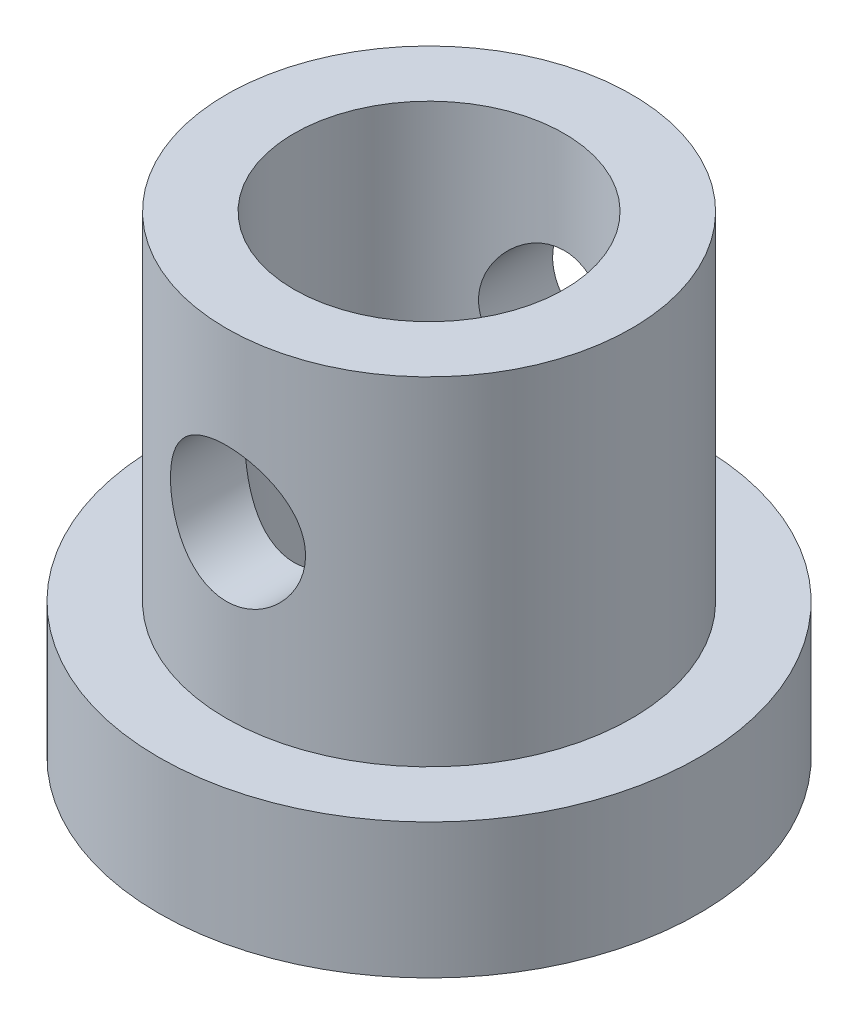
ISO-10303-21;
HEADER;
FILE_DESCRIPTION(('STEP AP214'),'2;1');
FILE_NAME('part.step','',(''),(''),'','','');
FILE_SCHEMA(('AUTOMOTIVE_DESIGN { 1 0 10303 214 1 1 1 1 }'));
ENDSEC;
DATA;
#1=APPLICATION_CONTEXT('core data for automotive mechanical design processes');
#2=APPLICATION_PROTOCOL_DEFINITION('international standard','automotive_design',2000,#1);
#3=PRODUCT_CONTEXT('',#1,'mechanical');
#4=PRODUCT('Part','Part','',(#3));
#5=PRODUCT_RELATED_PRODUCT_CATEGORY('part','',(#4));
#6=PRODUCT_DEFINITION_FORMATION('','',#4);
#7=PRODUCT_DEFINITION_CONTEXT('part definition',#1,'design');
#8=PRODUCT_DEFINITION('design','',#6,#7);
#9=PRODUCT_DEFINITION_SHAPE('','',#8);
#10=(LENGTH_UNIT() NAMED_UNIT(*) SI_UNIT(.MILLI.,.METRE.));
#11=(NAMED_UNIT(*) PLANE_ANGLE_UNIT() SI_UNIT($,.RADIAN.));
#12=(NAMED_UNIT(*) SI_UNIT($,.STERADIAN.) SOLID_ANGLE_UNIT());
#13=UNCERTAINTY_MEASURE_WITH_UNIT(LENGTH_MEASURE(1.E-05),#10,'distance_accuracy_value','');
#14=(GEOMETRIC_REPRESENTATION_CONTEXT(3) GLOBAL_UNCERTAINTY_ASSIGNED_CONTEXT((#13)) GLOBAL_UNIT_ASSIGNED_CONTEXT((#10,
#11,#12)) REPRESENTATION_CONTEXT('',''));
#15=CARTESIAN_POINT('',(0.,0.,0.));
#16=DIRECTION('',(0.,0.,1.));
#17=DIRECTION('',(1.,0.,0.));
#18=AXIS2_PLACEMENT_3D('',#15,#16,#17);
#19=CARTESIAN_POINT('',(0.,2.,0.));
#20=DIRECTION('',(0.,1.,0.));
#21=DIRECTION('',(0.,0.,1.));
#22=AXIS2_PLACEMENT_3D('',#19,#20,#21);
#23=PLANE('',#22);
#24=CARTESIAN_POINT('',(0.,2.,0.));
#25=DIRECTION('',(0.,1.,0.));
#26=DIRECTION('',(0.,0.,1.));
#27=AXIS2_PLACEMENT_3D('',#24,#25,#26);
#28=CIRCLE('',#27,4.);
#29=CARTESIAN_POINT('',(0.,2.,4.));
#30=VERTEX_POINT('',#29);
#31=EDGE_CURVE('E10',#30,#30,#28,.T.);
#32=ORIENTED_EDGE('',*,*,#31,.T.);
#33=EDGE_LOOP('',(#32));
#34=FACE_BOUND('',#33,.T.);
#35=CARTESIAN_POINT('',(0.,2.,0.));
#36=DIRECTION('',(0.,1.,0.));
#37=DIRECTION('',(0.,0.,1.));
#38=AXIS2_PLACEMENT_3D('',#35,#36,#37);
#39=CIRCLE('',#38,3.);
#40=CARTESIAN_POINT('',(0.,2.,3.));
#41=VERTEX_POINT('',#40);
#42=EDGE_CURVE('E118',#41,#41,#39,.T.);
#43=ORIENTED_EDGE('',*,*,#42,.F.);
#44=EDGE_LOOP('',(#43));
#45=FACE_BOUND('',#44,.T.);
#46=ADVANCED_FACE('F39',(#34,#45),#23,.T.);
#47=CARTESIAN_POINT('',(0.,0.,0.));
#48=DIRECTION('',(0.,1.,0.));
#49=DIRECTION('',(0.,0.,1.));
#50=AXIS2_PLACEMENT_3D('',#47,#48,#49);
#51=PLANE('',#50);
#52=CARTESIAN_POINT('',(0.,0.,0.));
#53=DIRECTION('',(0.,1.,0.));
#54=DIRECTION('',(0.,0.,1.));
#55=AXIS2_PLACEMENT_3D('',#52,#53,#54);
#56=CIRCLE('',#55,4.);
#57=CARTESIAN_POINT('',(0.,0.,4.));
#58=VERTEX_POINT('',#57);
#59=EDGE_CURVE('E53',#58,#58,#56,.T.);
#60=ORIENTED_EDGE('',*,*,#59,.F.);
#61=EDGE_LOOP('',(#60));
#62=FACE_BOUND('',#61,.T.);
#63=CARTESIAN_POINT('',(0.,0.,0.));
#64=DIRECTION('',(0.,1.,0.));
#65=DIRECTION('',(0.,0.,1.));
#66=AXIS2_PLACEMENT_3D('',#63,#64,#65);
#67=CIRCLE('',#66,2.);
#68=CARTESIAN_POINT('',(0.,0.,2.));
#69=VERTEX_POINT('',#68);
#70=EDGE_CURVE('E59',#69,#69,#67,.T.);
#71=ORIENTED_EDGE('',*,*,#70,.T.);
#72=EDGE_LOOP('',(#71));
#73=FACE_BOUND('',#72,.T.);
#74=ADVANCED_FACE('F102',(#62,#73),#51,.F.);
#75=CARTESIAN_POINT('',(0.,2.,0.));
#76=DIRECTION('',(0.,-1.,0.));
#77=DIRECTION('',(0.,0.,-1.));
#78=AXIS2_PLACEMENT_3D('',#75,#76,#77);
#79=CYLINDRICAL_SURFACE('',#78,4.);
#80=ORIENTED_EDGE('',*,*,#31,.F.);
#81=EDGE_LOOP('',(#80));
#82=FACE_BOUND('',#81,.T.);
#83=ORIENTED_EDGE('',*,*,#59,.T.);
#84=EDGE_LOOP('',(#83));
#85=FACE_BOUND('',#84,.T.);
#86=ADVANCED_FACE('F41',(#82,#85),#79,.T.);
#87=CARTESIAN_POINT('',(0.,2.,0.));
#88=DIRECTION('',(0.,-1.,0.));
#89=DIRECTION('',(0.,0.,-1.));
#90=AXIS2_PLACEMENT_3D('',#87,#88,#89);
#91=CYLINDRICAL_SURFACE('',#90,2.);
#92=CARTESIAN_POINT('',(0.,5.5,-2.));
#93=CARTESIAN_POINT('',(-0.0525719629529865,5.4999966976805,-1.99999713404151));
#94=CARTESIAN_POINT('',(-0.105206599698033,5.49582992687833,-1.99790491019518));
#95=CARTESIAN_POINT('',(-0.208920235268425,5.47934711965908,-1.98974156037396));
#96=CARTESIAN_POINT('',(-0.259996086713504,5.46701560700235,-1.98366287828984));
#97=CARTESIAN_POINT('',(-0.358933544880574,5.43480619138321,-1.96816279403312));
#98=CARTESIAN_POINT('',(-0.40680680293918,5.41495761575199,-1.9587543917752));
#99=CARTESIAN_POINT('',(-0.498472616806565,5.36842937863506,-1.93745776515779));
#100=CARTESIAN_POINT('',(-0.54226549399005,5.34175025575115,-1.9255697363353));
#101=CARTESIAN_POINT('',(-0.627507817761919,5.2804827505147,-1.89956258258057));
#102=CARTESIAN_POINT('',(-0.668655211122112,5.24551352076036,-1.88535199127536));
#103=CARTESIAN_POINT('',(-0.744779444866977,5.16947852075297,-1.85659970246744));
#104=CARTESIAN_POINT('',(-0.779751583106766,5.12840814822756,-1.84205776209035));
#105=CARTESIAN_POINT('',(-0.845252000450278,5.03751665047662,-1.81298951197347));
#106=CARTESIAN_POINT('',(-0.875225335551637,4.98726390165409,-1.79855186970132));
#107=CARTESIAN_POINT('',(-0.926168226890695,4.88163266401379,-1.77285978772321));
#108=CARTESIAN_POINT('',(-0.947144214966334,4.82625787127725,-1.7616030760699));
#109=CARTESIAN_POINT('',(-0.978132442188588,4.71533489457808,-1.74457867037809));
#110=CARTESIAN_POINT('',(-0.988725857080441,4.65999554793261,-1.73852271583714));
#111=CARTESIAN_POINT('',(-1.00042699330885,4.54802116222052,-1.73181889948528));
#112=CARTESIAN_POINT('',(-1.00154408837307,4.49138745912885,-1.73116569343288));
#113=CARTESIAN_POINT('',(-0.994687287172294,4.38571397568463,-1.73510930257248));
#114=CARTESIAN_POINT('',(-0.987784559536821,4.33657596877695,-1.73908763662014));
#115=CARTESIAN_POINT('',(-0.966939849056932,4.24027809062696,-1.7507622873385));
#116=CARTESIAN_POINT('',(-0.952995623897652,4.19311885469468,-1.75845978831776));
#117=CARTESIAN_POINT('',(-0.918209780386004,4.10077086743434,-1.77687476412741));
#118=CARTESIAN_POINT('',(-0.897215067115995,4.05565360121421,-1.78765840663999));
#119=CARTESIAN_POINT('',(-0.849041687668002,3.96936570740999,-1.81103404281404));
#120=CARTESIAN_POINT('',(-0.821860243812467,3.92819686439991,-1.82362684780191));
#121=CARTESIAN_POINT('',(-0.758066054912788,3.84547874725677,-1.85113157903286));
#122=CARTESIAN_POINT('',(-0.720694458369281,3.80454312642384,-1.86613510236746));
#123=CARTESIAN_POINT('',(-0.639555578741373,3.7292645814091,-1.89547623300407));
#124=CARTESIAN_POINT('',(-0.595785256574285,3.69492480796612,-1.90981351958801));
#125=CARTESIAN_POINT('',(-0.500516505831848,3.63231433897027,-1.93701987282964));
#126=CARTESIAN_POINT('',(-0.448753591599409,3.60439952755426,-1.94978984162007));
#127=CARTESIAN_POINT('',(-0.340466215488797,3.55790297095699,-1.97157881121242));
#128=CARTESIAN_POINT('',(-0.283945576265277,3.53931381498483,-1.98060078943553));
#129=CARTESIAN_POINT('',(-0.172766491660702,3.51352459628332,-1.99324333741436));
#130=CARTESIAN_POINT('',(-0.118341530548324,3.50550876425322,-1.99724938301312));
#131=CARTESIAN_POINT('',(-0.0087795999493535,3.49853526886551,-2.00073013459102));
#132=CARTESIAN_POINT('',(0.0463570198699014,3.49957331436052,-2.00020698721312));
#133=CARTESIAN_POINT('',(0.151232971985994,3.51020668841875,-1.99491192253441));
#134=CARTESIAN_POINT('',(0.201059408049954,3.51913253273003,-1.9904724568819));
#135=CARTESIAN_POINT('',(0.298406892301917,3.54423807189509,-1.97822171314819));
#136=CARTESIAN_POINT('',(0.345927685690997,3.56041856645336,-1.97041006334332));
#137=CARTESIAN_POINT('',(0.438888608449665,3.59999846643317,-1.95184251413669));
#138=CARTESIAN_POINT('',(0.484230397006154,3.62359105011681,-1.94100881769939));
#139=CARTESIAN_POINT('',(0.570461361698921,3.67710753564604,-1.91743974317109));
#140=CARTESIAN_POINT('',(0.611348629775282,3.70703413459343,-1.90470355565785));
#141=CARTESIAN_POINT('',(0.691767689290653,3.77576042533287,-1.87708221337464));
#142=CARTESIAN_POINT('',(0.730772077824639,3.81514286845357,-1.86210884848441));
#143=CARTESIAN_POINT('',(0.80185632111324,3.89992515126931,-1.83262391603874));
#144=CARTESIAN_POINT('',(0.833931385690841,3.94532911881638,-1.81811267381526));
#145=CARTESIAN_POINT('',(0.891707914497696,4.04364365420031,-1.79051192226068));
#146=CARTESIAN_POINT('',(0.917025495878637,4.09681126620859,-1.77752529663472));
#147=CARTESIAN_POINT('',(0.958082826013803,4.20751006769252,-1.75574072368126));
#148=CARTESIAN_POINT('',(0.97383491588757,4.26503552650119,-1.74693738240618));
#149=CARTESIAN_POINT('',(0.993861687449679,4.37691022286145,-1.73561501008667));
#150=CARTESIAN_POINT('',(0.999092996400865,4.43103425342904,-1.73257383460491));
#151=CARTESIAN_POINT('',(1.00068915438079,4.53944706717073,-1.73165354646175));
#152=CARTESIAN_POINT('',(0.997057846624399,4.59373576873943,-1.73377219627553));
#153=CARTESIAN_POINT('',(0.981926125592263,4.69548350153202,-1.74237862050025));
#154=CARTESIAN_POINT('',(0.9712083143428,4.7431004701444,-1.74843094482394));
#155=CARTESIAN_POINT('',(0.943175358224645,4.83580811942471,-1.76371016187917));
#156=CARTESIAN_POINT('',(0.92585809115981,4.88089798209197,-1.77293807569676));
#157=CARTESIAN_POINT('',(0.883815745300683,4.97062485098661,-1.79428530364528));
#158=CARTESIAN_POINT('',(0.858671137816457,5.0150279018297,-1.80655722396191));
#159=CARTESIAN_POINT('',(0.802150971636633,5.09927453618059,-1.8323533163459));
#160=CARTESIAN_POINT('',(0.770772171238647,5.13911573051849,-1.84587813794522));
#161=CARTESIAN_POINT('',(0.698203326664641,5.21814198235762,-1.87462323159313));
#162=CARTESIAN_POINT('',(0.656284423010171,5.25665910236192,-1.88984983311469));
#163=CARTESIAN_POINT('',(0.56615480622028,5.32626298342363,-1.91877752255088));
#164=CARTESIAN_POINT('',(0.517940723256785,5.35734573942629,-1.9324777860804));
#165=CARTESIAN_POINT('',(0.415931596819947,5.4112363627622,-1.95698009585103));
#166=CARTESIAN_POINT('',(0.362099503934615,5.43398416941144,-1.96776096562909));
#167=CARTESIAN_POINT('',(0.250742101294191,5.46980816791895,-1.98501341363465));
#168=CARTESIAN_POINT('',(0.193227799623166,5.48291184682958,-1.99149723372932));
#169=CARTESIAN_POINT('',(0.112601946483384,5.49389741107585,-1.99695461909663));
#170=CARTESIAN_POINT('',(0.0901618794394986,5.49618264086362,-1.99809365339202));
#171=CARTESIAN_POINT('',(0.0451517318071576,5.49923466551681,-1.99961696977865));
#172=CARTESIAN_POINT('',(0.0225816476473814,5.5000014184712,-2.00000123103763));
#173=CARTESIAN_POINT('',(0.,5.5,-2.));
#174=B_SPLINE_CURVE_WITH_KNOTS('',3,(#92,#93,#94,#95,#96,#97,#98,#99,#100,#101,#102,#103,#104,
#105,#106,#107,#108,#109,#110,#111,#112,#113,#114,#115,#116,#117,#118,#119,#120,#121,#122,#123,
#124,#125,#126,#127,#128,#129,#130,#131,#132,#133,#134,#135,#136,#137,#138,#139,#140,#141,#142,
#143,#144,#145,#146,#147,#148,#149,#150,#151,#152,#153,#154,#155,#156,#157,#158,#159,#160,#161,
#162,#163,#164,#165,#166,#167,#168,#169,#170,#171,#172,#173),.UNSPECIFIED.,.T.,.F.,(4,2,2,2,2,2,
2,2,2,2,2,2,2,2,2,2,2,2,2,2,2,2,2,2,2,2,2,2,2,2,2,2,2,2,2,2,2,2,2,2,4),(0.,0.157624257420293,
0.315548149709198,0.472862155492298,0.630163760581568,0.796981758718089,0.963926237654035,
1.14381726430753,1.32357947898281,1.49258012140229,1.6614135732902,1.81005712409321,
1.95874803925678,2.11090240168487,2.26312521260222,2.43464941333878,2.60625534598686,
2.78583022214441,2.9652621691228,3.12983290471346,3.29432564511476,3.44606906506122,
3.59782921630932,3.75392856027899,3.91009450748339,4.08159610644419,4.25321588615432,
4.43314682159674,4.61284511940778,4.77529307498373,4.93767059860005,5.08457930244183,
5.23153528783678,5.38836456775614,5.54527561138958,5.72125242752498,5.89732383376572,
6.07464013662925,6.2514490862493,6.31915280137697,6.38685838514847),.UNSPECIFIED.);
#175=CARTESIAN_POINT('',(0.,5.5,-2.));
#176=VERTEX_POINT('',#175);
#177=EDGE_CURVE('E90',#176,#176,#174,.T.);
#178=ORIENTED_EDGE('',*,*,#177,.F.);
#179=EDGE_LOOP('',(#178));
#180=FACE_BOUND('',#179,.T.);
#181=CARTESIAN_POINT('',(1.,4.5,1.73205080756888));
#182=CARTESIAN_POINT('',(0.999996363074532,4.44789219180475,1.73205534728459));
#183=CARTESIAN_POINT('',(0.995899970733217,4.39571858847496,1.73443801187756));
#184=CARTESIAN_POINT('',(0.979723209898053,4.29297273532285,1.74362366452052));
#185=CARTESIAN_POINT('',(0.967626064554179,4.24240408495659,1.75043594055559));
#186=CARTESIAN_POINT('',(0.936099948699812,4.14454833565606,1.76749346605398));
#187=CARTESIAN_POINT('',(0.916709952493731,4.09724534752641,1.77772043473252));
#188=CARTESIAN_POINT('',(0.871267525376372,4.00657579800328,1.80042664816858));
#189=CARTESIAN_POINT('',(0.845214734035774,3.96320944973754,1.81290601476065));
#190=CARTESIAN_POINT('',(0.784666540530879,3.87769427144249,1.83996869057441));
#191=CARTESIAN_POINT('',(0.74965203614377,3.83594086432646,1.85464063637954));
#192=CARTESIAN_POINT('',(0.673253807614468,3.75859161159329,1.88371982785706));
#193=CARTESIAN_POINT('',(0.631866925782293,3.72299883741648,1.8981269383125));
#194=CARTESIAN_POINT('',(0.540489563414546,3.65663284885234,1.92621476952949));
#195=CARTESIAN_POINT('',(0.490107189012575,3.62634623214047,1.93978106418172));
#196=CARTESIAN_POINT('',(0.384157026599505,3.57485914675424,1.96350756099529));
#197=CARTESIAN_POINT('',(0.328592538138156,3.55365294386283,1.97366991183742));
#198=CARTESIAN_POINT('',(0.218044943925978,3.5224953386989,1.98880461244237));
#199=CARTESIAN_POINT('',(0.163301790488818,3.51185047364447,1.99409480220892));
#200=CARTESIAN_POINT('',(0.0525706286978487,3.49983388132496,2.00007583846067));
#201=CARTESIAN_POINT('',(-0.00341660584373794,3.49845654320429,2.0007694678459));
#202=CARTESIAN_POINT('',(-0.109832524423749,3.50474667397035,1.9976298191645));
#203=CARTESIAN_POINT('',(-0.160321199176791,3.51163801552122,1.9941849589216));
#204=CARTESIAN_POINT('',(-0.259313771918321,3.53288084390466,1.98374245259747));
#205=CARTESIAN_POINT('',(-0.307817521093925,3.54723288897622,1.97674454066394));
#206=CARTESIAN_POINT('',(-0.402309391569553,3.58308256608981,1.95971583287654));
#207=CARTESIAN_POINT('',(-0.448253423515178,3.60467631317207,1.94964441529199));
#208=CARTESIAN_POINT('',(-0.535976801513328,3.65426341620149,1.92737645986687));
#209=CARTESIAN_POINT('',(-0.577754648838645,3.68225906330235,1.91517916157484));
#210=CARTESIAN_POINT('',(-0.660173660898194,3.74689535153302,1.88844394399229));
#211=CARTESIAN_POINT('',(-0.70033407502936,3.78410302832601,1.87379375998175));
#212=CARTESIAN_POINT('',(-0.77410437029778,3.86458972493018,1.84454340586812));
#213=CARTESIAN_POINT('',(-0.80770921157423,3.90787337227406,1.82994328265629));
#214=CARTESIAN_POINT('',(-0.869505334642211,4.00264819242409,1.80144156092485));
#215=CARTESIAN_POINT('',(-0.897217314978051,4.05448602305421,1.78764319990708));
#216=CARTESIAN_POINT('',(-0.943319113001231,4.162937671359,1.76375450278576));
#217=CARTESIAN_POINT('',(-0.961718658210889,4.21954643301756,1.75366030046067));
#218=CARTESIAN_POINT('',(-0.98718021102504,4.33121451128279,1.73944635817034));
#219=CARTESIAN_POINT('',(-0.995025122119976,4.38604111904355,1.73491655848496));
#220=CARTESIAN_POINT('',(-1.00151694661143,4.49640134151654,1.7311791936161));
#221=CARTESIAN_POINT('',(-1.00017035731503,4.55193442911979,1.73196786889312));
#222=CARTESIAN_POINT('',(-0.989036043343966,4.65565391857873,1.73834336540585));
#223=CARTESIAN_POINT('',(-0.980187816712467,4.70397945110793,1.74339587506654));
#224=CARTESIAN_POINT('',(-0.955696284632441,4.79836778627096,1.75694021551341));
#225=CARTESIAN_POINT('',(-0.940050778623615,4.84442985074661,1.76543316005034));
#226=CARTESIAN_POINT('',(-0.901647588604886,4.9354113309027,1.78536222079657));
#227=CARTESIAN_POINT('',(-0.878594063692724,4.98017901685355,1.79691643243063));
#228=CARTESIAN_POINT('',(-0.826287064015805,5.06546927153899,1.8215611949725));
#229=CARTESIAN_POINT('',(-0.797030404332217,5.10598964351328,1.83465253355148));
#230=CARTESIAN_POINT('',(-0.728837167198854,5.18697876752355,1.86287998456336));
#231=CARTESIAN_POINT('',(-0.689145272314967,5.22679715071766,1.87806583154289));
#232=CARTESIAN_POINT('',(-0.603404495398289,5.29941223799359,1.90734234977892));
#233=CARTESIAN_POINT('',(-0.557353474655348,5.33220657023054,1.92143265007709));
#234=CARTESIAN_POINT('',(-0.458535362558758,5.3905737259501,1.94741361690957));
#235=CARTESIAN_POINT('',(-0.405623097574114,5.41593311821091,1.95923641672029));
#236=CARTESIAN_POINT('',(-0.295522364641082,5.45713790385739,1.97883354959301));
#237=CARTESIAN_POINT('',(-0.238337701392176,5.47299165136631,1.98661143676373));
#238=CARTESIAN_POINT('',(-0.126979682330418,5.49336856417466,1.99667508181883));
#239=CARTESIAN_POINT('',(-0.0730114438504576,5.49879787587611,1.99939927908191));
#240=CARTESIAN_POINT('',(0.035125985951203,5.5008432654544,2.00042130375131));
#241=CARTESIAN_POINT('',(0.0892951002950863,5.49746242852356,1.9987206806689));
#242=CARTESIAN_POINT('',(0.192537992317147,5.48258359320438,1.99133968837923));
#243=CARTESIAN_POINT('',(0.241712317811263,5.47163515074233,1.9859289466799));
#244=CARTESIAN_POINT('',(0.337445952183617,5.44267300069703,1.97192093663423));
#245=CARTESIAN_POINT('',(0.384004884955508,5.42465827990655,1.96332321132796));
#246=CARTESIAN_POINT('',(0.475423406244884,5.38127294783403,1.9432593074812));
#247=CARTESIAN_POINT('',(0.520125142700045,5.35562067679216,1.93168617198799));
#248=CARTESIAN_POINT('',(0.604774641814024,5.29804206914095,1.90688133141826));
#249=CARTESIAN_POINT('',(0.644720207414906,5.26611285088433,1.89364886558361));
#250=CARTESIAN_POINT('',(0.722914004156891,5.1932028609773,1.86528610226628));
#251=CARTESIAN_POINT('',(0.760597684539271,5.15163751252281,1.85009799011698));
#252=CARTESIAN_POINT('',(0.828663287394674,5.06254927887023,1.82063076162852));
#253=CARTESIAN_POINT('',(0.859038750010058,5.01502117913232,1.80635245761865));
#254=CARTESIAN_POINT('',(0.912431079785654,4.91336335341905,1.77999605304916));
#255=CARTESIAN_POINT('',(0.935185065960939,4.85907246887127,1.7680017425627));
#256=CARTESIAN_POINT('',(0.970878709506411,4.74666759566022,1.74866156328352));
#257=CARTESIAN_POINT('',(0.983851191175346,4.68856711108732,1.74130016147702));
#258=CARTESIAN_POINT('',(0.994367007864415,4.60819464434801,1.7352927260179));
#259=CARTESIAN_POINT('',(0.996476104963851,4.58663210560212,1.73408129005152));
#260=CARTESIAN_POINT('',(0.999293405089963,4.54338351931776,1.7324593588775));
#261=CARTESIAN_POINT('',(1.00000151439987,4.52169746361413,1.73204891725109));
#262=CARTESIAN_POINT('',(1.,4.5,1.73205080756888));
#263=B_SPLINE_CURVE_WITH_KNOTS('',3,(#181,#182,#183,#184,#185,#186,#187,#188,#189,#190,#191,
#192,#193,#194,#195,#196,#197,#198,#199,#200,#201,#202,#203,#204,#205,#206,#207,#208,#209,#210,
#211,#212,#213,#214,#215,#216,#217,#218,#219,#220,#221,#222,#223,#224,#225,#226,#227,#228,#229,
#230,#231,#232,#233,#234,#235,#236,#237,#238,#239,#240,#241,#242,#243,#244,#245,#246,#247,#248,
#249,#250,#251,#252,#253,#254,#255,#256,#257,#258,#259,#260,#261,#262),.UNSPECIFIED.,.T.,.F.,(4,
2,2,2,2,2,2,2,2,2,2,2,2,2,2,2,2,2,2,2,2,2,2,2,2,2,2,2,2,2,2,2,2,2,2,2,2,2,2,2,4),(0.,
0.156232122594716,0.312792892824805,0.468528595918885,0.624272725445149,0.792862312498234,
0.96153571084371,1.14157892238763,1.32150826963891,1.48863484967935,1.6556602368604,
1.80816097484538,1.96067312517455,2.11529534731147,2.26997299350272,2.43927191456891,
2.60870048245919,2.78888841729448,2.96888774211705,3.13462290854212,3.30024093188373,
3.44774183424025,3.59529052436063,3.74967296406088,3.90413486220047,4.07806743580613,
4.25205864978202,4.43064181412966,4.60906779808772,4.77112270389487,4.93312086793972,
5.08444424871493,5.23578933512013,5.39360750719472,5.55149830100719,5.72510241850067,
5.89885942845154,6.07810749038605,6.2567513300276,6.32180135185309,6.38685572494541),.UNSPECIFIED.);
#264=CARTESIAN_POINT('',(1.,4.5,1.73205080756888));
#265=VERTEX_POINT('',#264);
#266=EDGE_CURVE('E84',#265,#265,#263,.T.);
#267=ORIENTED_EDGE('',*,*,#266,.F.);
#268=EDGE_LOOP('',(#267));
#269=FACE_BOUND('',#268,.T.);
#270=ORIENTED_EDGE('',*,*,#70,.F.);
#271=EDGE_LOOP('',(#270));
#272=FACE_BOUND('',#271,.T.);
#273=CARTESIAN_POINT('',(0.,7.,0.));
#274=DIRECTION('',(0.,1.,0.));
#275=DIRECTION('',(0.,0.,1.));
#276=AXIS2_PLACEMENT_3D('',#273,#274,#275);
#277=CIRCLE('',#276,2.);
#278=CARTESIAN_POINT('',(0.,7.,2.));
#279=VERTEX_POINT('',#278);
#280=EDGE_CURVE('E124',#279,#279,#277,.T.);
#281=ORIENTED_EDGE('',*,*,#280,.T.);
#282=EDGE_LOOP('',(#281));
#283=FACE_BOUND('',#282,.T.);
#284=ADVANCED_FACE('F95',(#180,#269,#272,#283),#91,.F.);
#285=CARTESIAN_POINT('',(0.,7.,0.));
#286=DIRECTION('',(0.,1.,0.));
#287=DIRECTION('',(0.,0.,1.));
#288=AXIS2_PLACEMENT_3D('',#285,#286,#287);
#289=PLANE('',#288);
#290=CARTESIAN_POINT('',(0.,7.,0.));
#291=DIRECTION('',(0.,1.,0.));
#292=DIRECTION('',(0.,0.,1.));
#293=AXIS2_PLACEMENT_3D('',#290,#291,#292);
#294=CIRCLE('',#293,3.);
#295=CARTESIAN_POINT('',(0.,7.,3.));
#296=VERTEX_POINT('',#295);
#297=EDGE_CURVE('E115',#296,#296,#294,.T.);
#298=ORIENTED_EDGE('',*,*,#297,.T.);
#299=EDGE_LOOP('',(#298));
#300=FACE_BOUND('',#299,.T.);
#301=ORIENTED_EDGE('',*,*,#280,.F.);
#302=EDGE_LOOP('',(#301));
#303=FACE_BOUND('',#302,.T.);
#304=ADVANCED_FACE('F78',(#300,#303),#289,.T.);
#305=CARTESIAN_POINT('',(0.,7.,0.));
#306=DIRECTION('',(0.,-1.,0.));
#307=DIRECTION('',(0.,0.,-1.));
#308=AXIS2_PLACEMENT_3D('',#305,#306,#307);
#309=CYLINDRICAL_SURFACE('',#308,3.);
#310=CARTESIAN_POINT('',(0.,5.5,-3.));
#311=CARTESIAN_POINT('',(-0.0545633628867233,5.50000025373164,-3.00000015300943));
#312=CARTESIAN_POINT('',(-0.10912519453855,5.49551973387278,-2.99849769507545));
#313=CARTESIAN_POINT('',(-0.216641760872972,5.47777089118278,-2.99265210203281));
#314=CARTESIAN_POINT('',(-0.269596328118818,5.46450165605108,-2.98830867202153));
#315=CARTESIAN_POINT('',(-0.372332789501776,5.42968075661595,-2.97725307906443));
#316=CARTESIAN_POINT('',(-0.422119825886034,5.40814293754073,-2.97054487730853));
#317=CARTESIAN_POINT('',(-0.517374936805324,5.35745882716165,-2.95544445717342));
#318=CARTESIAN_POINT('',(-0.562842156958706,5.3283110349974,-2.94705190667778));
#319=CARTESIAN_POINT('',(-0.649741675022266,5.26217419514125,-2.92914094443005));
#320=CARTESIAN_POINT('',(-0.691003700298309,5.22496876573951,-2.91959556463785));
#321=CARTESIAN_POINT('',(-0.766832692702083,5.14423284529344,-2.90060314783122));
#322=CARTESIAN_POINT('',(-0.801398185489462,5.10070096507149,-2.89115613290549));
#323=CARTESIAN_POINT('',(-0.863824942227859,5.00701488480354,-2.87313332477274));
#324=CARTESIAN_POINT('',(-0.891464858221032,4.95670626026788,-2.86459039275688));
#325=CARTESIAN_POINT('',(-0.937818873877721,4.85182390554145,-2.84975305418601));
#326=CARTESIAN_POINT('',(-0.956535697386765,4.79725148283726,-2.84345796160746));
#327=CARTESIAN_POINT('',(-0.983873461509163,4.68732677850329,-2.83411303269377));
#328=CARTESIAN_POINT('',(-0.992813448271769,4.63206279151094,-2.83096095769611));
#329=CARTESIAN_POINT('',(-1.00134112333448,4.52073624584412,-2.82795656629508));
#330=CARTESIAN_POINT('',(-1.00093170160472,4.46467393929081,-2.8281032302273));
#331=CARTESIAN_POINT('',(-0.991019903703419,4.35606336955598,-2.8315901500818));
#332=CARTESIAN_POINT('',(-0.981933913166995,4.30347159708098,-2.83478415867533));
#333=CARTESIAN_POINT('',(-0.955606162849417,4.20060658039317,-2.84376657724551));
#334=CARTESIAN_POINT('',(-0.938363426591871,4.15033361456493,-2.84955529784108));
#335=CARTESIAN_POINT('',(-0.895939058060211,4.05258725040852,-2.86317911131249));
#336=CARTESIAN_POINT('',(-0.870634048707263,4.00517197453047,-2.87104565793117));
#337=CARTESIAN_POINT('',(-0.812889106303139,3.91512909172027,-2.88792558575726));
#338=CARTESIAN_POINT('',(-0.780447112364005,3.87250287306662,-2.89693929790464));
#339=CARTESIAN_POINT('',(-0.707349332682237,3.79090840183923,-2.91567329167741));
#340=CARTESIAN_POINT('',(-0.666353150076311,3.75224730549093,-2.92540589354843));
#341=CARTESIAN_POINT('',(-0.578339569970064,3.6822687333366,-2.94406938387037));
#342=CARTESIAN_POINT('',(-0.531321595660815,3.6509519618355,-2.95300019538067));
#343=CARTESIAN_POINT('',(-0.431947613046268,3.59630369976493,-2.96917107937794));
#344=CARTESIAN_POINT('',(-0.379543276416337,3.57305450865927,-2.97639350008039));
#345=CARTESIAN_POINT('',(-0.271269083364508,3.53579682604429,-2.98820567144435));
#346=CARTESIAN_POINT('',(-0.215400438154954,3.52178512457656,-2.99279633654879));
#347=CARTESIAN_POINT('',(-0.104383829529304,3.50394433397764,-2.99867627071441));
#348=CARTESIAN_POINT('',(-0.0493095998648455,3.49970019082725,-3.00010001833731));
#349=CARTESIAN_POINT('',(0.0607750699602361,3.50033267359847,-2.99988902694825));
#350=CARTESIAN_POINT('',(0.115785519319647,3.50520775997987,-2.99825480419352));
#351=CARTESIAN_POINT('',(0.222519866304259,3.52361190773597,-2.99220024717114));
#352=CARTESIAN_POINT('',(0.274292806834856,3.53688620604952,-2.98786198711228));
#353=CARTESIAN_POINT('',(0.374855958579561,3.5713934444667,-2.97691846830034));
#354=CARTESIAN_POINT('',(0.423645788508559,3.59262739946768,-2.97031292046541));
#355=CARTESIAN_POINT('',(0.518288296393321,3.6430704318409,-2.95528931287427));
#356=CARTESIAN_POINT('',(0.564029959217329,3.6724745932836,-2.94682814756305));
#357=CARTESIAN_POINT('',(0.650064830135403,3.73819415001305,-2.92905253915743));
#358=CARTESIAN_POINT('',(0.690356367794894,3.77451165603016,-2.91973783591888));
#359=CARTESIAN_POINT('',(0.766252507807013,3.85497875100826,-2.90076847982472));
#360=CARTESIAN_POINT('',(0.801560969248491,3.89940922693325,-2.89111761095155));
#361=CARTESIAN_POINT('',(0.864257522320854,3.9937715678045,-2.87299973286981));
#362=CARTESIAN_POINT('',(0.891645547920843,4.0437034786102,-2.8645327335312));
#363=CARTESIAN_POINT('',(0.937596930423361,4.1476730153066,-2.84982391820308));
#364=CARTESIAN_POINT('',(0.956178132197766,4.20170207924278,-2.84357760900632));
#365=CARTESIAN_POINT('',(0.983894666792163,4.31237865012415,-2.83410832399133));
#366=CARTESIAN_POINT('',(0.993034254961243,4.36902496543306,-2.83088398622698));
#367=CARTESIAN_POINT('',(1.00127628247038,4.48019709601321,-2.82797858875071));
#368=CARTESIAN_POINT('',(1.00087025731093,4.53468234025174,-2.82812400344299));
#369=CARTESIAN_POINT('',(0.991242293454878,4.64276507489974,-2.8315126992356));
#370=CARTESIAN_POINT('',(0.982020879458887,4.69636261795291,-2.83475579595884));
#371=CARTESIAN_POINT('',(0.95537181312698,4.80013566301267,-2.84384524278943));
#372=CARTESIAN_POINT('',(0.93810334601488,4.85035682500723,-2.84964098015514));
#373=CARTESIAN_POINT('',(0.895979365760382,4.94722740693553,-2.86316398825434));
#374=CARTESIAN_POINT('',(0.871122168553979,4.99387603118726,-2.87089168765297));
#375=CARTESIAN_POINT('',(0.813260692583249,5.08448366992369,-2.8878282922406));
#376=CARTESIAN_POINT('',(0.779948242764532,5.12823650189859,-2.89708711641604));
#377=CARTESIAN_POINT('',(0.706642883135697,5.20968981338399,-2.91583356283786));
#378=CARTESIAN_POINT('',(0.666648084451495,5.24738857568802,-2.92532124912518));
#379=CARTESIAN_POINT('',(0.579241556920674,5.31714441228924,-2.94390030525393));
#380=CARTESIAN_POINT('',(0.531601513499725,5.34892434775102,-2.95296181801216));
#381=CARTESIAN_POINT('',(0.431357357406629,5.40399042885063,-2.96925991172652));
#382=CARTESIAN_POINT('',(0.37875451813235,5.42727874592204,-2.9764969590794));
#383=CARTESIAN_POINT('',(0.272493647200975,5.46372163248868,-2.98805515068532));
#384=CARTESIAN_POINT('',(0.218987757676408,5.47728246626338,-2.9924921242252));
#385=CARTESIAN_POINT('',(0.110320416010247,5.49542028067713,-2.99846407064225));
#386=CARTESIAN_POINT('',(0.0551594255687465,5.49999974349654,-2.99999984531906));
#387=CARTESIAN_POINT('',(0.,5.5,-3.));
#388=B_SPLINE_CURVE_WITH_KNOTS('',3,(#310,#311,#312,#313,#314,#315,#316,#317,#318,#319,#320,
#321,#322,#323,#324,#325,#326,#327,#328,#329,#330,#331,#332,#333,#334,#335,#336,#337,#338,#339,
#340,#341,#342,#343,#344,#345,#346,#347,#348,#349,#350,#351,#352,#353,#354,#355,#356,#357,#358,
#359,#360,#361,#362,#363,#364,#365,#366,#367,#368,#369,#370,#371,#372,#373,#374,#375,#376,#377,
#378,#379,#380,#381,#382,#383,#384,#385,#386,#387),.UNSPECIFIED.,.T.,.F.,(4,2,2,2,2,2,2,2,2,2,2,
2,2,2,2,2,2,2,2,2,2,2,2,2,2,2,2,2,2,2,2,2,2,2,2,2,2,2,4),(0.,0.163487106026011,
0.326991185267521,0.490222672870274,0.6534863777991,0.821846842827559,0.990244332875302,
1.1634838482347,1.33667044692833,1.5040192574184,1.67131633987485,1.8309682655128,
1.99063930855482,2.15288171155131,2.31517102558207,2.48593305811367,2.65671145966618,
2.82918405650358,3.00159668877208,3.1665358317517,3.33144713164177,3.49158157978213,
3.65173645284104,3.81610399843736,3.98052180821891,4.15241022880752,4.32430008234997,
4.49584013824417,4.66730284700846,4.82995666056619,4.99260079341185,5.15215587070228,
5.31174638165788,5.47830066681615,5.64490211113589,5.8179966082491,5.99104681142266,
6.15636558363624,6.3216386602795),.UNSPECIFIED.);
#389=CARTESIAN_POINT('',(0.,5.5,-3.));
#390=VERTEX_POINT('',#389);
#391=EDGE_CURVE('E43',#390,#390,#388,.T.);
#392=ORIENTED_EDGE('',*,*,#391,.T.);
#393=EDGE_LOOP('',(#392));
#394=FACE_BOUND('',#393,.T.);
#395=CARTESIAN_POINT('',(1.,4.5,2.82842712474619));
#396=CARTESIAN_POINT('',(1.0000002579478,4.44553182518932,2.82842694532735));
#397=CARTESIAN_POINT('',(0.99553478369814,4.39106520022848,2.83001769372806));
#398=CARTESIAN_POINT('',(0.977851131702564,4.28374557904939,2.8361757417458));
#399=CARTESIAN_POINT('',(0.964631512170673,4.23089285013606,2.8407435316722));
#400=CARTESIAN_POINT('',(0.929955485680263,4.12837310698719,2.85228203663888));
#401=CARTESIAN_POINT('',(0.908515221402,4.07870007055312,2.8592480396464));
#402=CARTESIAN_POINT('',(0.858061628442627,3.98363995145621,2.87479122017008));
#403=CARTESIAN_POINT('',(0.829046628860523,3.9382538174475,2.88336875305432));
#404=CARTESIAN_POINT('',(0.763051146442527,3.85128003766051,2.90154489405589));
#405=CARTESIAN_POINT('',(0.725824341377825,3.80988457132796,2.91116894844139));
#406=CARTESIAN_POINT('',(0.64498766721449,3.73379319877568,2.93013864801508));
#407=CARTESIAN_POINT('',(0.601376775052402,3.69909836841772,2.93948424829099));
#408=CARTESIAN_POINT('',(0.507604507964985,3.63652110267032,2.95713866921658));
#409=CARTESIAN_POINT('',(0.457301911224519,3.60884002938202,2.96541407701568));
#410=CARTESIAN_POINT('',(0.352431222987482,3.56240841487251,2.9796958677102));
#411=CARTESIAN_POINT('',(0.297864285687215,3.5436554668231,2.98570286203012));
#412=CARTESIAN_POINT('',(0.188028817433493,3.5162641453676,2.99459075431897));
#413=CARTESIAN_POINT('',(0.132850754852968,3.50729655374299,2.99757314777558));
#414=CARTESIAN_POINT('',(0.0216978748240916,3.49868370663934,3.00043608218249));
#415=CARTESIAN_POINT('',(-0.0342767335438922,3.49903604834758,3.00031742262891));
#416=CARTESIAN_POINT('',(-0.143103515193817,3.50884425456603,2.99706039618736));
#417=CARTESIAN_POINT('',(-0.195992048591666,3.51794252847451,2.99404064755135));
#418=CARTESIAN_POINT('',(-0.29944343882216,3.54439298098045,2.98546967339714));
#419=CARTESIAN_POINT('',(-0.350006137779175,3.56174571897976,2.97991827631115));
#420=CARTESIAN_POINT('',(-0.448152474842013,3.60442131730613,2.96675670293292));
#421=CARTESIAN_POINT('',(-0.495688220968997,3.62984593854678,2.9591204252427));
#422=CARTESIAN_POINT('',(-0.585924325527169,3.68785970544839,2.94258393038665));
#423=CARTESIAN_POINT('',(-0.628623334384769,3.72045084332664,2.93368336200518));
#424=CARTESIAN_POINT('',(-0.710100866551906,3.79367439346074,2.9150619185089));
#425=CARTESIAN_POINT('',(-0.748600157067555,3.83461315784544,2.90532215172667));
#426=CARTESIAN_POINT('',(-0.818277259595889,3.92244872572266,2.88647335245111));
#427=CARTESIAN_POINT('',(-0.849453943273005,3.96934644571324,2.8773644173145));
#428=CARTESIAN_POINT('',(-0.903987455042732,4.06865362561542,2.86070525135531));
#429=CARTESIAN_POINT('',(-0.927226463651049,4.12113213136781,2.85317909338821));
#430=CARTESIAN_POINT('',(-0.964443193299506,4.22957139426626,2.84081650878299));
#431=CARTESIAN_POINT('',(-0.978424795755529,4.28553068122182,2.83597895501223));
#432=CARTESIAN_POINT('',(-0.996161282090474,4.39663835540062,2.8297963630207));
#433=CARTESIAN_POINT('',(-1.00034909550575,4.45170942474572,2.82830360315139));
#434=CARTESIAN_POINT('',(-0.999605438911605,4.56177614911704,2.828566720628));
#435=CARTESIAN_POINT('',(-0.99467562522726,4.61677181602476,2.83032200792768));
#436=CARTESIAN_POINT('',(-0.97622565155183,4.72315696571116,2.83673618089379));
#437=CARTESIAN_POINT('',(-0.963006393980555,4.77460543015064,2.84129325440593));
#438=CARTESIAN_POINT('',(-0.928713862560596,4.87454360623938,2.8526855367127));
#439=CARTESIAN_POINT('',(-0.907639196363457,4.92303279159083,2.85952114934907));
#440=CARTESIAN_POINT('',(-0.857474340738901,5.01738042084694,2.87496877595718));
#441=CARTESIAN_POINT('',(-0.828151118358488,5.06310664264179,2.8836302566561));
#442=CARTESIAN_POINT('',(-0.762585630557568,5.14914605238373,2.90165768730984));
#443=CARTESIAN_POINT('',(-0.726341325498785,5.18945763866122,2.91102384443799));
#444=CARTESIAN_POINT('',(-0.645891705900323,5.26552798409063,2.92995038637844));
#445=CARTESIAN_POINT('',(-0.601387270546652,5.30097439001885,2.93949843577895));
#446=CARTESIAN_POINT('',(-0.506827291400258,5.36391614234804,2.9572685161311));
#447=CARTESIAN_POINT('',(-0.456771944864553,5.39141177116243,2.96549059417695));
#448=CARTESIAN_POINT('',(-0.352779862432296,5.43742010486172,2.97964405810603));
#449=CARTESIAN_POINT('',(-0.298871123321197,5.45599127714807,2.98559030004531));
#450=CARTESIAN_POINT('',(-0.188458465846017,5.4837277420601,2.99458610837774));
#451=CARTESIAN_POINT('',(-0.13195549195389,5.4928964298805,2.99763672034018));
#452=CARTESIAN_POINT('',(-0.0208153358600417,5.50126207760564,3.00041863236257));
#453=CARTESIAN_POINT('',(0.0337847239200181,5.50090745393238,3.00029920089441));
#454=CARTESIAN_POINT('',(0.142111145000172,5.49134269185359,2.99712196519396));
#455=CARTESIAN_POINT('',(0.195837576819054,5.48213327184724,2.99406439933567));
#456=CARTESIAN_POINT('',(0.300042119432059,5.45541776542403,2.98540914954421));
#457=CARTESIAN_POINT('',(0.350558270912794,5.43804578464705,2.9798525836118));
#458=CARTESIAN_POINT('',(0.447978350939788,5.39562246890287,2.96677160704464));
#459=CARTESIAN_POINT('',(0.494881624142408,5.37056974480306,2.95924684047901));
#460=CARTESIAN_POINT('',(0.585634016308808,5.31243048789792,2.94265868828001));
#461=CARTESIAN_POINT('',(0.629306251557696,5.27908131461808,2.93354872492381));
#462=CARTESIAN_POINT('',(0.710581026272338,5.20574260884409,2.91492988791425));
#463=CARTESIAN_POINT('',(0.748181621624259,5.16575095773832,2.90542088771397));
#464=CARTESIAN_POINT('',(0.817741808833464,5.07839064441197,2.88663279827365));
#465=CARTESIAN_POINT('',(0.849422965999216,5.03079448901923,2.87737727995345));
#466=CARTESIAN_POINT('',(0.904314343299799,4.93066557310135,2.86060193316303));
#467=CARTESIAN_POINT('',(0.927526776814559,4.87813410698576,2.8530816513617));
#468=CARTESIAN_POINT('',(0.963843828206626,4.77203817597617,2.84101334230535));
#469=CARTESIAN_POINT('',(0.977357909163268,4.71862773643428,2.83634632944799));
#470=CARTESIAN_POINT('',(0.995434320161694,4.61014394948453,2.8300538361394));
#471=CARTESIAN_POINT('',(0.999999739196501,4.55507118256425,2.82842730615135));
#472=CARTESIAN_POINT('',(1.,4.5,2.82842712474619));
#473=B_SPLINE_CURVE_WITH_KNOTS('',3,(#395,#396,#397,#398,#399,#400,#401,#402,#403,#404,#405,
#406,#407,#408,#409,#410,#411,#412,#413,#414,#415,#416,#417,#418,#419,#420,#421,#422,#423,#424,
#425,#426,#427,#428,#429,#430,#431,#432,#433,#434,#435,#436,#437,#438,#439,#440,#441,#442,#443,
#444,#445,#446,#447,#448,#449,#450,#451,#452,#453,#454,#455,#456,#457,#458,#459,#460,#461,#462,
#463,#464,#465,#466,#467,#468,#469,#470,#471,#472),.UNSPECIFIED.,.T.,.F.,(4,2,2,2,2,2,2,2,2,2,2,
2,2,2,2,2,2,2,2,2,2,2,2,2,2,2,2,2,2,2,2,2,2,2,2,2,2,2,4),(0.,0.163200584775416,0.32642805496888,
0.489336627454544,0.652281166139158,0.821013374229397,0.989772651673595,1.16293506139029,
1.33605076382161,1.50314318760306,1.67019253297699,1.83069004820941,1.99119844184608,
2.15381654855707,2.31647991869393,2.48680174359289,2.65714979607477,2.82992639837376,
3.00263051349688,3.16754291357512,3.33242535830306,3.49164395761849,3.65089079140018,
3.81518857728788,3.979534856552,4.15178808164165,4.32403518750605,4.49513791183924,
4.66617882997229,4.82918084670708,4.99216964002854,5.15256956033502,5.31299850756315,
5.47935519513706,5.64576504425704,5.81868902729217,5.99156778259939,6.15663212153685,
6.32163947179229),.UNSPECIFIED.);
#474=CARTESIAN_POINT('',(1.,4.5,2.82842712474619));
#475=VERTEX_POINT('',#474);
#476=EDGE_CURVE('E63',#475,#475,#473,.T.);
#477=ORIENTED_EDGE('',*,*,#476,.T.);
#478=EDGE_LOOP('',(#477));
#479=FACE_BOUND('',#478,.T.);
#480=ORIENTED_EDGE('',*,*,#297,.F.);
#481=EDGE_LOOP('',(#480));
#482=FACE_BOUND('',#481,.T.);
#483=ORIENTED_EDGE('',*,*,#42,.T.);
#484=EDGE_LOOP('',(#483));
#485=FACE_BOUND('',#484,.T.);
#486=ADVANCED_FACE('F69',(#394,#479,#482,#485),#309,.T.);
#487=CARTESIAN_POINT('',(0.,4.5,-4.));
#488=DIRECTION('',(0.,0.,1.));
#489=DIRECTION('',(1.,0.,0.));
#490=AXIS2_PLACEMENT_3D('',#487,#488,#489);
#491=CYLINDRICAL_SURFACE('',#490,1.);
#492=ORIENTED_EDGE('',*,*,#266,.T.);
#493=EDGE_LOOP('',(#492));
#494=FACE_BOUND('',#493,.T.);
#495=ORIENTED_EDGE('',*,*,#476,.F.);
#496=EDGE_LOOP('',(#495));
#497=FACE_BOUND('',#496,.T.);
#498=ADVANCED_FACE('F76',(#494,#497),#491,.F.);
#499=ORIENTED_EDGE('',*,*,#177,.T.);
#500=EDGE_LOOP('',(#499));
#501=FACE_BOUND('',#500,.T.);
#502=ORIENTED_EDGE('',*,*,#391,.F.);
#503=EDGE_LOOP('',(#502));
#504=FACE_BOUND('',#503,.T.);
#505=ADVANCED_FACE('F73',(#501,#504),#491,.F.);
#506=CLOSED_SHELL('',(#46,#74,#86,#284,#304,#486,#498,#505));
#507=MANIFOLD_SOLID_BREP('B2',#506);
#508=ADVANCED_BREP_SHAPE_REPRESENTATION('',(#18,#507),#14);
#509=SHAPE_DEFINITION_REPRESENTATION(#9,#508);
ENDSEC;
END-ISO-10303-21;
